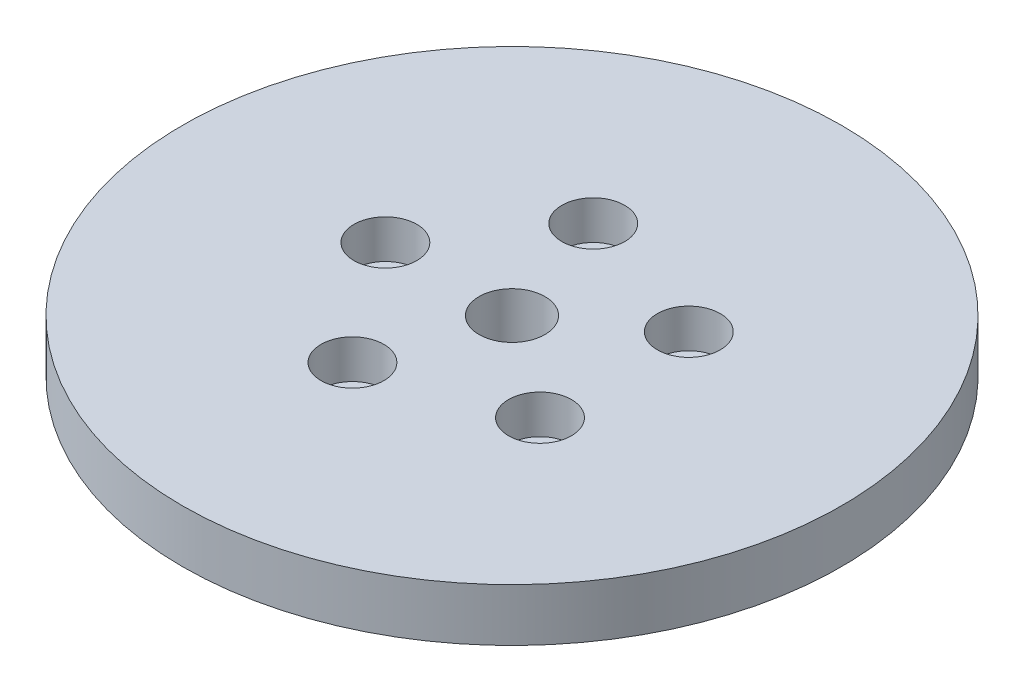
ISO-10303-21;
HEADER;
FILE_DESCRIPTION(('STEP AP214'),'2;1');
FILE_NAME('part.step','',(''),(''),'','','');
FILE_SCHEMA(('AUTOMOTIVE_DESIGN { 1 0 10303 214 1 1 1 1 }'));
ENDSEC;
DATA;
#1=APPLICATION_CONTEXT('core data for automotive mechanical design processes');
#2=APPLICATION_PROTOCOL_DEFINITION('international standard','automotive_design',2000,#1);
#3=PRODUCT_CONTEXT('',#1,'mechanical');
#4=PRODUCT('Part','Part','',(#3));
#5=PRODUCT_RELATED_PRODUCT_CATEGORY('part','',(#4));
#6=PRODUCT_DEFINITION_FORMATION('','',#4);
#7=PRODUCT_DEFINITION_CONTEXT('part definition',#1,'design');
#8=PRODUCT_DEFINITION('design','',#6,#7);
#9=PRODUCT_DEFINITION_SHAPE('','',#8);
#10=(LENGTH_UNIT() NAMED_UNIT(*) SI_UNIT(.MILLI.,.METRE.));
#11=(NAMED_UNIT(*) PLANE_ANGLE_UNIT() SI_UNIT($,.RADIAN.));
#12=(NAMED_UNIT(*) SI_UNIT($,.STERADIAN.) SOLID_ANGLE_UNIT());
#13=UNCERTAINTY_MEASURE_WITH_UNIT(LENGTH_MEASURE(1.E-05),#10,'distance_accuracy_value','');
#14=(GEOMETRIC_REPRESENTATION_CONTEXT(3) GLOBAL_UNCERTAINTY_ASSIGNED_CONTEXT((#13)) GLOBAL_UNIT_ASSIGNED_CONTEXT((#10,
#11,#12)) REPRESENTATION_CONTEXT('',''));
#15=CARTESIAN_POINT('',(0.,0.,0.));
#16=DIRECTION('',(0.,0.,1.));
#17=DIRECTION('',(1.,0.,0.));
#18=AXIS2_PLACEMENT_3D('',#15,#16,#17);
#19=CARTESIAN_POINT('',(0.,12.,0.));
#20=DIRECTION('',(0.,-1.,0.));
#21=DIRECTION('',(0.,0.,-1.));
#22=AXIS2_PLACEMENT_3D('',#19,#20,#21);
#23=CYLINDRICAL_SURFACE('',#22,75.);
#24=CARTESIAN_POINT('',(0.,12.,0.));
#25=DIRECTION('',(0.,1.,0.));
#26=DIRECTION('',(0.,0.,1.));
#27=AXIS2_PLACEMENT_3D('',#24,#25,#26);
#28=CIRCLE('',#27,75.);
#29=CARTESIAN_POINT('',(0.,12.,75.));
#30=VERTEX_POINT('',#29);
#31=EDGE_CURVE('E10',#30,#30,#28,.T.);
#32=ORIENTED_EDGE('',*,*,#31,.F.);
#33=EDGE_LOOP('',(#32));
#34=FACE_BOUND('',#33,.T.);
#35=CARTESIAN_POINT('',(0.,0.,0.));
#36=DIRECTION('',(0.,1.,0.));
#37=DIRECTION('',(0.,0.,1.));
#38=AXIS2_PLACEMENT_3D('',#35,#36,#37);
#39=CIRCLE('',#38,75.);
#40=CARTESIAN_POINT('',(0.,0.,75.));
#41=VERTEX_POINT('',#40);
#42=EDGE_CURVE('E37',#41,#41,#39,.T.);
#43=ORIENTED_EDGE('',*,*,#42,.T.);
#44=EDGE_LOOP('',(#43));
#45=FACE_BOUND('',#44,.T.);
#46=ADVANCED_FACE('F40',(#34,#45),#23,.T.);
#47=CARTESIAN_POINT('',(0.,12.,0.));
#48=DIRECTION('',(0.,1.,0.));
#49=DIRECTION('',(0.,0.,1.));
#50=AXIS2_PLACEMENT_3D('',#47,#48,#49);
#51=PLANE('',#50);
#52=CARTESIAN_POINT('',(-8.90389268911763,12.,-27.4033639460714));
#53=DIRECTION('',(0.,1.,0.));
#54=DIRECTION('',(-0.95105651629515,0.,0.309016994374958));
#55=AXIS2_PLACEMENT_3D('',#52,#53,#54);
#56=CIRCLE('',#55,7.15581576066889);
#57=CARTESIAN_POINT('',(-15.7094778977093,12.,-25.1920952674085));
#58=VERTEX_POINT('',#57);
#59=EDGE_CURVE('E70',#58,#58,#56,.T.);
#60=ORIENTED_EDGE('',*,*,#59,.F.);
#61=EDGE_LOOP('',(#60));
#62=FACE_BOUND('',#61,.T.);
#63=CARTESIAN_POINT('',(23.3106936922907,12.,-16.9362103247558));
#64=DIRECTION('',(0.,1.,0.));
#65=DIRECTION('',(-0.58778525229248,0.,-0.809016994374942));
#66=AXIS2_PLACEMENT_3D('',#63,#64,#65);
#67=CIRCLE('',#66,7.15581576066889);
#68=CARTESIAN_POINT('',(19.1046107200474,12.,-22.725386883753));
#69=VERTEX_POINT('',#68);
#70=EDGE_CURVE('E71',#69,#69,#67,.T.);
#71=ORIENTED_EDGE('',*,*,#70,.F.);
#72=EDGE_LOOP('',(#71));
#73=FACE_BOUND('',#72,.T.);
#74=CARTESIAN_POINT('',(23.3106936922909,12.,16.9362103247555));
#75=DIRECTION('',(0.,1.,0.));
#76=DIRECTION('',(0.587785252292469,0.,-0.809016994374951));
#77=AXIS2_PLACEMENT_3D('',#74,#75,#76);
#78=CIRCLE('',#77,7.15581576066889);
#79=CARTESIAN_POINT('',(27.5167766645341,12.,11.1470337657582));
#80=VERTEX_POINT('',#79);
#81=EDGE_CURVE('E78',#80,#80,#78,.T.);
#82=ORIENTED_EDGE('',*,*,#81,.F.);
#83=EDGE_LOOP('',(#82));
#84=FACE_BOUND('',#83,.T.);
#85=CARTESIAN_POINT('',(-8.90389268911724,12.,27.4033639460715));
#86=DIRECTION('',(0.,1.,0.));
#87=DIRECTION('',(0.951056516295155,0.,0.309016994374945));
#88=AXIS2_PLACEMENT_3D('',#85,#86,#87);
#89=CIRCLE('',#88,7.15581576066889);
#90=CARTESIAN_POINT('',(-2.09830748052552,12.,29.6146326247343));
#91=VERTEX_POINT('',#90);
#92=EDGE_CURVE('E61',#91,#91,#89,.T.);
#93=ORIENTED_EDGE('',*,*,#92,.F.);
#94=EDGE_LOOP('',(#93));
#95=FACE_BOUND('',#94,.T.);
#96=CARTESIAN_POINT('',(-28.813602006347,12.,0.));
#97=DIRECTION('',(0.,1.,0.));
#98=DIRECTION('',(0.,0.,1.));
#99=AXIS2_PLACEMENT_3D('',#96,#97,#98);
#100=CIRCLE('',#99,7.15581576066889);
#101=CARTESIAN_POINT('',(-28.813602006347,12.,7.15581576066889));
#102=VERTEX_POINT('',#101);
#103=EDGE_CURVE('E54',#102,#102,#100,.T.);
#104=ORIENTED_EDGE('',*,*,#103,.F.);
#105=EDGE_LOOP('',(#104));
#106=FACE_BOUND('',#105,.T.);
#107=CARTESIAN_POINT('',(0.,12.,0.));
#108=DIRECTION('',(0.,1.,0.));
#109=DIRECTION('',(0.,0.,1.));
#110=AXIS2_PLACEMENT_3D('',#107,#108,#109);
#111=CIRCLE('',#110,7.5);
#112=CARTESIAN_POINT('',(0.,12.,7.5));
#113=VERTEX_POINT('',#112);
#114=EDGE_CURVE('E50',#113,#113,#111,.T.);
#115=ORIENTED_EDGE('',*,*,#114,.F.);
#116=EDGE_LOOP('',(#115));
#117=FACE_BOUND('',#116,.T.);
#118=ORIENTED_EDGE('',*,*,#31,.T.);
#119=EDGE_LOOP('',(#118));
#120=FACE_BOUND('',#119,.T.);
#121=ADVANCED_FACE('F94',(#62,#73,#84,#95,#106,#117,#120),#51,.T.);
#122=CARTESIAN_POINT('',(0.,0.,0.));
#123=DIRECTION('',(0.,1.,0.));
#124=DIRECTION('',(0.,0.,1.));
#125=AXIS2_PLACEMENT_3D('',#122,#123,#124);
#126=PLANE('',#125);
#127=CARTESIAN_POINT('',(0.,0.,0.));
#128=DIRECTION('',(0.,1.,0.));
#129=DIRECTION('',(0.,0.,1.));
#130=AXIS2_PLACEMENT_3D('',#127,#128,#129);
#131=CIRCLE('',#130,7.5);
#132=CARTESIAN_POINT('',(0.,0.,7.5));
#133=VERTEX_POINT('',#132);
#134=EDGE_CURVE('E47',#133,#133,#131,.T.);
#135=ORIENTED_EDGE('',*,*,#134,.T.);
#136=EDGE_LOOP('',(#135));
#137=FACE_BOUND('',#136,.T.);
#138=ORIENTED_EDGE('',*,*,#42,.F.);
#139=EDGE_LOOP('',(#138));
#140=FACE_BOUND('',#139,.T.);
#141=ADVANCED_FACE('F100',(#137,#140),#126,.F.);
#142=CARTESIAN_POINT('',(0.,12.,0.));
#143=DIRECTION('',(0.,-1.,0.));
#144=DIRECTION('',(0.,0.,-1.));
#145=AXIS2_PLACEMENT_3D('',#142,#143,#144);
#146=CYLINDRICAL_SURFACE('',#145,7.5);
#147=ORIENTED_EDGE('',*,*,#114,.T.);
#148=EDGE_LOOP('',(#147));
#149=FACE_BOUND('',#148,.T.);
#150=ORIENTED_EDGE('',*,*,#134,.F.);
#151=EDGE_LOOP('',(#150));
#152=FACE_BOUND('',#151,.T.);
#153=ADVANCED_FACE('F106',(#149,#152),#146,.F.);
#154=CARTESIAN_POINT('',(-28.813602006347,3.18560760185951,0.));
#155=DIRECTION('',(0.,1.,0.));
#156=DIRECTION('',(0.,0.,1.));
#157=AXIS2_PLACEMENT_3D('',#154,#155,#156);
#158=CYLINDRICAL_SURFACE('',#157,7.15581576066889);
#159=CARTESIAN_POINT('',(-28.813602006347,3.18560760185951,0.));
#160=DIRECTION('',(0.,1.,0.));
#161=DIRECTION('',(0.,0.,1.));
#162=AXIS2_PLACEMENT_3D('',#159,#160,#161);
#163=CIRCLE('',#162,7.15581576066889);
#164=CARTESIAN_POINT('',(-28.813602006347,3.18560760185951,7.15581576066889));
#165=VERTEX_POINT('',#164);
#166=EDGE_CURVE('E55',#165,#165,#163,.T.);
#167=ORIENTED_EDGE('',*,*,#166,.F.);
#168=EDGE_LOOP('',(#167));
#169=FACE_BOUND('',#168,.T.);
#170=ORIENTED_EDGE('',*,*,#103,.T.);
#171=EDGE_LOOP('',(#170));
#172=FACE_BOUND('',#171,.T.);
#173=ADVANCED_FACE('F108',(#169,#172),#158,.F.);
#174=CARTESIAN_POINT('',(-28.813602006347,3.18560760185951,0.));
#175=DIRECTION('',(0.,1.,0.));
#176=DIRECTION('',(0.,0.,1.));
#177=AXIS2_PLACEMENT_3D('',#174,#175,#176);
#178=PLANE('',#177);
#179=ORIENTED_EDGE('',*,*,#166,.T.);
#180=EDGE_LOOP('',(#179));
#181=FACE_BOUND('',#180,.T.);
#182=ADVANCED_FACE('F138',(#181),#178,.T.);
#183=CARTESIAN_POINT('',(-8.90389268911724,3.18560760185951,27.4033639460715));
#184=DIRECTION('',(0.,1.,0.));
#185=DIRECTION('',(0.,0.,1.));
#186=AXIS2_PLACEMENT_3D('',#183,#184,#185);
#187=CYLINDRICAL_SURFACE('',#186,7.15581576066889);
#188=CARTESIAN_POINT('',(-8.90389268911724,3.18560760185951,27.4033639460715));
#189=DIRECTION('',(0.,1.,0.));
#190=DIRECTION('',(0.951056516295155,0.,0.309016994374945));
#191=AXIS2_PLACEMENT_3D('',#188,#189,#190);
#192=CIRCLE('',#191,7.15581576066889);
#193=CARTESIAN_POINT('',(-2.09830748052552,3.18560760185951,29.6146326247343));
#194=VERTEX_POINT('',#193);
#195=EDGE_CURVE('E59',#194,#194,#192,.T.);
#196=ORIENTED_EDGE('',*,*,#195,.F.);
#197=EDGE_LOOP('',(#196));
#198=FACE_BOUND('',#197,.T.);
#199=ORIENTED_EDGE('',*,*,#92,.T.);
#200=EDGE_LOOP('',(#199));
#201=FACE_BOUND('',#200,.T.);
#202=ADVANCED_FACE('F150',(#198,#201),#187,.F.);
#203=CARTESIAN_POINT('',(-8.90389268911724,3.18560760185951,27.4033639460715));
#204=DIRECTION('',(0.,1.,0.));
#205=DIRECTION('',(0.951056516295155,0.,0.309016994374945));
#206=AXIS2_PLACEMENT_3D('',#203,#204,#205);
#207=PLANE('',#206);
#208=ORIENTED_EDGE('',*,*,#195,.T.);
#209=EDGE_LOOP('',(#208));
#210=FACE_BOUND('',#209,.T.);
#211=ADVANCED_FACE('F89',(#210),#207,.T.);
#212=CARTESIAN_POINT('',(23.3106936922909,3.18560760185951,16.9362103247555));
#213=DIRECTION('',(0.,1.,0.));
#214=DIRECTION('',(0.,0.,1.));
#215=AXIS2_PLACEMENT_3D('',#212,#213,#214);
#216=CYLINDRICAL_SURFACE('',#215,7.15581576066889);
#217=CARTESIAN_POINT('',(23.3106936922909,3.18560760185951,16.9362103247555));
#218=DIRECTION('',(0.,1.,0.));
#219=DIRECTION('',(0.587785252292469,0.,-0.809016994374951));
#220=AXIS2_PLACEMENT_3D('',#217,#218,#219);
#221=CIRCLE('',#220,7.15581576066889);
#222=CARTESIAN_POINT('',(27.5167766645341,3.18560760185951,11.1470337657582));
#223=VERTEX_POINT('',#222);
#224=EDGE_CURVE('E63',#223,#223,#221,.T.);
#225=ORIENTED_EDGE('',*,*,#224,.F.);
#226=EDGE_LOOP('',(#225));
#227=FACE_BOUND('',#226,.T.);
#228=ORIENTED_EDGE('',*,*,#81,.T.);
#229=EDGE_LOOP('',(#228));
#230=FACE_BOUND('',#229,.T.);
#231=ADVANCED_FACE('F87',(#227,#230),#216,.F.);
#232=CARTESIAN_POINT('',(23.3106936922909,3.18560760185951,16.9362103247555));
#233=DIRECTION('',(0.,1.,0.));
#234=DIRECTION('',(0.587785252292469,0.,-0.809016994374951));
#235=AXIS2_PLACEMENT_3D('',#232,#233,#234);
#236=PLANE('',#235);
#237=ORIENTED_EDGE('',*,*,#224,.T.);
#238=EDGE_LOOP('',(#237));
#239=FACE_BOUND('',#238,.T.);
#240=ADVANCED_FACE('F84',(#239),#236,.T.);
#241=CARTESIAN_POINT('',(23.3106936922907,3.18560760185951,-16.9362103247558));
#242=DIRECTION('',(0.,1.,0.));
#243=DIRECTION('',(0.,0.,1.));
#244=AXIS2_PLACEMENT_3D('',#241,#242,#243);
#245=CYLINDRICAL_SURFACE('',#244,7.15581576066889);
#246=CARTESIAN_POINT('',(23.3106936922907,3.18560760185951,-16.9362103247558));
#247=DIRECTION('',(0.,1.,0.));
#248=DIRECTION('',(-0.58778525229248,0.,-0.809016994374942));
#249=AXIS2_PLACEMENT_3D('',#246,#247,#248);
#250=CIRCLE('',#249,7.15581576066889);
#251=CARTESIAN_POINT('',(19.1046107200474,3.18560760185951,-22.725386883753));
#252=VERTEX_POINT('',#251);
#253=EDGE_CURVE('E76',#252,#252,#250,.T.);
#254=ORIENTED_EDGE('',*,*,#253,.F.);
#255=EDGE_LOOP('',(#254));
#256=FACE_BOUND('',#255,.T.);
#257=ORIENTED_EDGE('',*,*,#70,.T.);
#258=EDGE_LOOP('',(#257));
#259=FACE_BOUND('',#258,.T.);
#260=ADVANCED_FACE('F185',(#256,#259),#245,.F.);
#261=CARTESIAN_POINT('',(23.3106936922907,3.18560760185951,-16.9362103247558));
#262=DIRECTION('',(0.,1.,0.));
#263=DIRECTION('',(-0.58778525229248,0.,-0.809016994374942));
#264=AXIS2_PLACEMENT_3D('',#261,#262,#263);
#265=PLANE('',#264);
#266=ORIENTED_EDGE('',*,*,#253,.T.);
#267=EDGE_LOOP('',(#266));
#268=FACE_BOUND('',#267,.T.);
#269=ADVANCED_FACE('F189',(#268),#265,.T.);
#270=CARTESIAN_POINT('',(-8.90389268911763,3.18560760185951,-27.4033639460714));
#271=DIRECTION('',(0.,1.,0.));
#272=DIRECTION('',(0.,0.,1.));
#273=AXIS2_PLACEMENT_3D('',#270,#271,#272);
#274=CYLINDRICAL_SURFACE('',#273,7.15581576066889);
#275=CARTESIAN_POINT('',(-8.90389268911763,3.18560760185951,-27.4033639460714));
#276=DIRECTION('',(0.,1.,0.));
#277=DIRECTION('',(-0.95105651629515,0.,0.309016994374958));
#278=AXIS2_PLACEMENT_3D('',#275,#276,#277);
#279=CIRCLE('',#278,7.15581576066889);
#280=CARTESIAN_POINT('',(-15.7094778977093,3.18560760185951,-25.1920952674085));
#281=VERTEX_POINT('',#280);
#282=EDGE_CURVE('E69',#281,#281,#279,.T.);
#283=ORIENTED_EDGE('',*,*,#282,.F.);
#284=EDGE_LOOP('',(#283));
#285=FACE_BOUND('',#284,.T.);
#286=ORIENTED_EDGE('',*,*,#59,.T.);
#287=EDGE_LOOP('',(#286));
#288=FACE_BOUND('',#287,.T.);
#289=ADVANCED_FACE('F200',(#285,#288),#274,.F.);
#290=CARTESIAN_POINT('',(-8.90389268911763,3.18560760185951,-27.4033639460714));
#291=DIRECTION('',(0.,1.,0.));
#292=DIRECTION('',(-0.95105651629515,0.,0.309016994374958));
#293=AXIS2_PLACEMENT_3D('',#290,#291,#292);
#294=PLANE('',#293);
#295=ORIENTED_EDGE('',*,*,#282,.T.);
#296=EDGE_LOOP('',(#295));
#297=FACE_BOUND('',#296,.T.);
#298=ADVANCED_FACE('F208',(#297),#294,.T.);
#299=CLOSED_SHELL('',(#46,#121,#141,#153,#173,#182,#202,#211,#231,#240,#260,#269,#289,#298));
#300=MANIFOLD_SOLID_BREP('B2',#299);
#301=ADVANCED_BREP_SHAPE_REPRESENTATION('',(#18,#300),#14);
#302=SHAPE_DEFINITION_REPRESENTATION(#9,#301);
ENDSEC;
END-ISO-10303-21;
